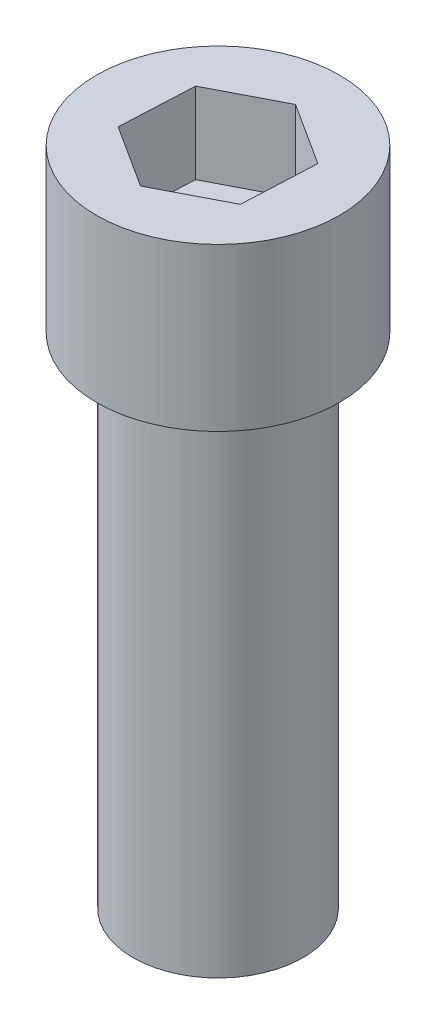
ISO-10303-21;
HEADER;
FILE_DESCRIPTION(('STEP AP214'),'2;1');
FILE_NAME('part.step','',(''),(''),'','','');
FILE_SCHEMA(('AUTOMOTIVE_DESIGN { 1 0 10303 214 1 1 1 1 }'));
ENDSEC;
DATA;
#1=APPLICATION_CONTEXT('core data for automotive mechanical design processes');
#2=APPLICATION_PROTOCOL_DEFINITION('international standard','automotive_design',2000,#1);
#3=PRODUCT_CONTEXT('',#1,'mechanical');
#4=PRODUCT('Part','Part','',(#3));
#5=PRODUCT_RELATED_PRODUCT_CATEGORY('part','',(#4));
#6=PRODUCT_DEFINITION_FORMATION('','',#4);
#7=PRODUCT_DEFINITION_CONTEXT('part definition',#1,'design');
#8=PRODUCT_DEFINITION('design','',#6,#7);
#9=PRODUCT_DEFINITION_SHAPE('','',#8);
#10=(LENGTH_UNIT() NAMED_UNIT(*) SI_UNIT(.MILLI.,.METRE.));
#11=(NAMED_UNIT(*) PLANE_ANGLE_UNIT() SI_UNIT($,.RADIAN.));
#12=(NAMED_UNIT(*) SI_UNIT($,.STERADIAN.) SOLID_ANGLE_UNIT());
#13=UNCERTAINTY_MEASURE_WITH_UNIT(LENGTH_MEASURE(1.E-05),#10,'distance_accuracy_value','');
#14=(GEOMETRIC_REPRESENTATION_CONTEXT(3) GLOBAL_UNCERTAINTY_ASSIGNED_CONTEXT((#13)) GLOBAL_UNIT_ASSIGNED_CONTEXT((#10,
#11,#12)) REPRESENTATION_CONTEXT('',''));
#15=CARTESIAN_POINT('',(0.,0.,0.));
#16=DIRECTION('',(0.,0.,1.));
#17=DIRECTION('',(1.,0.,0.));
#18=AXIS2_PLACEMENT_3D('',#15,#16,#17);
#19=CARTESIAN_POINT('',(0.,34.8,0.));
#20=DIRECTION('',(0.,-1.,0.));
#21=DIRECTION('',(0.,0.,-1.));
#22=AXIS2_PLACEMENT_3D('',#19,#20,#21);
#23=CYLINDRICAL_SURFACE('',#22,5.25);
#24=CARTESIAN_POINT('',(0.,34.8,0.));
#25=DIRECTION('',(0.,1.,0.));
#26=DIRECTION('',(0.,0.,1.));
#27=AXIS2_PLACEMENT_3D('',#24,#25,#26);
#28=CIRCLE('',#27,5.25);
#29=CARTESIAN_POINT('',(0.,34.8,5.25));
#30=VERTEX_POINT('',#29);
#31=EDGE_CURVE('E11',#30,#30,#28,.T.);
#32=ORIENTED_EDGE('',*,*,#31,.F.);
#33=EDGE_LOOP('',(#32));
#34=FACE_BOUND('',#33,.T.);
#35=CARTESIAN_POINT('',(0.,4.,0.));
#36=DIRECTION('',(0.,-1.,0.));
#37=DIRECTION('',(0.,0.,-1.));
#38=AXIS2_PLACEMENT_3D('',#35,#36,#37);
#39=CIRCLE('',#38,5.25);
#40=CARTESIAN_POINT('',(0.,4.,-5.25));
#41=VERTEX_POINT('',#40);
#42=EDGE_CURVE('E135',#41,#41,#39,.T.);
#43=ORIENTED_EDGE('',*,*,#42,.F.);
#44=EDGE_LOOP('',(#43));
#45=FACE_BOUND('',#44,.T.);
#46=ADVANCED_FACE('F39',(#34,#45),#23,.T.);
#47=CARTESIAN_POINT('',(0.,34.8,0.));
#48=DIRECTION('',(0.,1.,0.));
#49=DIRECTION('',(0.,0.,1.));
#50=AXIS2_PLACEMENT_3D('',#47,#48,#49);
#51=PLANE('',#50);
#52=CARTESIAN_POINT('',(0.,34.8,0.));
#53=DIRECTION('',(0.,1.,0.));
#54=DIRECTION('',(0.,0.,1.));
#55=AXIS2_PLACEMENT_3D('',#52,#53,#54);
#56=CIRCLE('',#55,7.5);
#57=CARTESIAN_POINT('',(0.,34.8,7.5));
#58=VERTEX_POINT('',#57);
#59=EDGE_CURVE('E154',#58,#58,#56,.T.);
#60=ORIENTED_EDGE('',*,*,#59,.F.);
#61=EDGE_LOOP('',(#60));
#62=FACE_BOUND('',#61,.T.);
#63=ORIENTED_EDGE('',*,*,#31,.T.);
#64=EDGE_LOOP('',(#63));
#65=FACE_BOUND('',#64,.T.);
#66=ADVANCED_FACE('F172',(#62,#65),#51,.F.);
#67=CARTESIAN_POINT('',(0.,44.8,0.));
#68=DIRECTION('',(0.,-1.,0.));
#69=DIRECTION('',(0.,0.,-1.));
#70=AXIS2_PLACEMENT_3D('',#67,#68,#69);
#71=CYLINDRICAL_SURFACE('',#70,7.5);
#72=CARTESIAN_POINT('',(0.,44.8,0.));
#73=DIRECTION('',(0.,1.,0.));
#74=DIRECTION('',(0.,0.,1.));
#75=AXIS2_PLACEMENT_3D('',#72,#73,#74);
#76=CIRCLE('',#75,7.5);
#77=CARTESIAN_POINT('',(0.,44.8,7.5));
#78=VERTEX_POINT('',#77);
#79=EDGE_CURVE('E47',#78,#78,#76,.T.);
#80=ORIENTED_EDGE('',*,*,#79,.F.);
#81=EDGE_LOOP('',(#80));
#82=FACE_BOUND('',#81,.T.);
#83=ORIENTED_EDGE('',*,*,#59,.T.);
#84=EDGE_LOOP('',(#83));
#85=FACE_BOUND('',#84,.T.);
#86=ADVANCED_FACE('F170',(#82,#85),#71,.T.);
#87=CARTESIAN_POINT('',(0.,44.8,0.));
#88=DIRECTION('',(0.,1.,0.));
#89=DIRECTION('',(0.,0.,1.));
#90=AXIS2_PLACEMENT_3D('',#87,#88,#89);
#91=PLANE('',#90);
#92=DIRECTION('',(-0.841859471217915,0.,-0.539696795173634));
#93=VECTOR('',#92,1.);
#94=CARTESIAN_POINT('',(4.06379105691766,44.8,-2.10080339720881));
#95=LINE('',#94,#93);
#96=CARTESIAN_POINT('',(4.06379105691766,44.8,-2.10080339720881));
#97=VERTEX_POINT('',#96);
#98=CARTESIAN_POINT('',(0.212546418119348,44.8,-4.56974798956711));
#99=VERTEX_POINT('',#98);
#100=EDGE_CURVE('E54',#97,#99,#95,.T.);
#101=ORIENTED_EDGE('',*,*,#100,.F.);
#102=DIRECTION('',(0.046461399352456,0.,-0.998920086078066));
#103=VECTOR('',#102,1.);
#104=CARTESIAN_POINT('',(3.85124463879831,44.8,2.4689445923583));
#105=LINE('',#104,#103);
#106=CARTESIAN_POINT('',(3.85124463879831,44.8,2.4689445923583));
#107=VERTEX_POINT('',#106);
#108=EDGE_CURVE('E148',#107,#97,#105,.T.);
#109=ORIENTED_EDGE('',*,*,#108,.F.);
#110=DIRECTION('',(0.888320870570372,0.,-0.459223290904432));
#111=VECTOR('',#110,1.);
#112=CARTESIAN_POINT('',(-0.212546418119345,44.8,4.56974798956711));
#113=LINE('',#112,#111);
#114=CARTESIAN_POINT('',(-0.212546418119345,44.8,4.56974798956711));
#115=VERTEX_POINT('',#114);
#116=EDGE_CURVE('E145',#115,#107,#113,.T.);
#117=ORIENTED_EDGE('',*,*,#116,.F.);
#118=DIRECTION('',(0.841859471217915,0.,0.539696795173634));
#119=VECTOR('',#118,1.);
#120=CARTESIAN_POINT('',(-4.06379105691766,44.8,2.10080339720881));
#121=LINE('',#120,#119);
#122=CARTESIAN_POINT('',(-4.06379105691766,44.8,2.10080339720881));
#123=VERTEX_POINT('',#122);
#124=EDGE_CURVE('E102',#123,#115,#121,.T.);
#125=ORIENTED_EDGE('',*,*,#124,.F.);
#126=DIRECTION('',(-0.0464613993524562,0.,0.998920086078066));
#127=VECTOR('',#126,1.);
#128=CARTESIAN_POINT('',(-3.85124463879831,44.8,-2.4689445923583));
#129=LINE('',#128,#127);
#130=CARTESIAN_POINT('',(-3.85124463879831,44.8,-2.4689445923583));
#131=VERTEX_POINT('',#130);
#132=EDGE_CURVE('E139',#131,#123,#129,.T.);
#133=ORIENTED_EDGE('',*,*,#132,.F.);
#134=DIRECTION('',(-0.888320870570372,0.,0.459223290904432));
#135=VECTOR('',#134,1.);
#136=CARTESIAN_POINT('',(0.212546418119348,44.8,-4.56974798956711));
#137=LINE('',#136,#135);
#138=EDGE_CURVE('E134',#99,#131,#137,.T.);
#139=ORIENTED_EDGE('',*,*,#138,.F.);
#140=EDGE_LOOP('',(#101,#109,#117,#125,#133,#139));
#141=FACE_BOUND('',#140,.T.);
#142=ORIENTED_EDGE('',*,*,#79,.T.);
#143=EDGE_LOOP('',(#142));
#144=FACE_BOUND('',#143,.T.);
#145=ADVANCED_FACE('F195',(#141,#144),#91,.T.);
#146=CARTESIAN_POINT('',(4.06379105691766,39.8,-2.10080339720881));
#147=DIRECTION('',(0.539696795173634,0.,-0.841859471217916));
#148=DIRECTION('',(-0.841859471217915,0.,-0.539696795173634));
#149=AXIS2_PLACEMENT_3D('',#146,#147,#148);
#150=PLANE('',#149);
#151=ORIENTED_EDGE('',*,*,#100,.T.);
#152=DIRECTION('',(0.,1.,0.));
#153=VECTOR('',#152,1.);
#154=CARTESIAN_POINT('',(0.212546418119348,39.8,-4.56974798956711));
#155=LINE('',#154,#153);
#156=CARTESIAN_POINT('',(0.212546418119348,39.8,-4.56974798956711));
#157=VERTEX_POINT('',#156);
#158=EDGE_CURVE('E84',#157,#99,#155,.T.);
#159=ORIENTED_EDGE('',*,*,#158,.F.);
#160=DIRECTION('',(-0.841859471217915,0.,-0.539696795173634));
#161=VECTOR('',#160,1.);
#162=CARTESIAN_POINT('',(4.06379105691766,39.8,-2.10080339720881));
#163=LINE('',#162,#161);
#164=CARTESIAN_POINT('',(4.06379105691766,39.8,-2.10080339720881));
#165=VERTEX_POINT('',#164);
#166=EDGE_CURVE('E151',#165,#157,#163,.T.);
#167=ORIENTED_EDGE('',*,*,#166,.F.);
#168=DIRECTION('',(0.,1.,0.));
#169=VECTOR('',#168,1.);
#170=CARTESIAN_POINT('',(4.06379105691766,39.8,-2.10080339720881));
#171=LINE('',#170,#169);
#172=EDGE_CURVE('E62',#165,#97,#171,.T.);
#173=ORIENTED_EDGE('',*,*,#172,.T.);
#174=EDGE_LOOP('',(#151,#159,#167,#173));
#175=FACE_BOUND('',#174,.T.);
#176=ADVANCED_FACE('F200',(#175),#150,.F.);
#177=CARTESIAN_POINT('',(3.85124463879831,39.8,2.4689445923583));
#178=DIRECTION('',(0.998920086078066,0.,0.046461399352456));
#179=DIRECTION('',(0.046461399352456,0.,-0.998920086078067));
#180=AXIS2_PLACEMENT_3D('',#177,#178,#179);
#181=PLANE('',#180);
#182=ORIENTED_EDGE('',*,*,#108,.T.);
#183=ORIENTED_EDGE('',*,*,#172,.F.);
#184=DIRECTION('',(0.046461399352456,0.,-0.998920086078066));
#185=VECTOR('',#184,1.);
#186=CARTESIAN_POINT('',(3.85124463879831,39.8,2.4689445923583));
#187=LINE('',#186,#185);
#188=CARTESIAN_POINT('',(3.85124463879831,39.8,2.4689445923583));
#189=VERTEX_POINT('',#188);
#190=EDGE_CURVE('E116',#189,#165,#187,.T.);
#191=ORIENTED_EDGE('',*,*,#190,.F.);
#192=DIRECTION('',(0.,1.,0.));
#193=VECTOR('',#192,1.);
#194=CARTESIAN_POINT('',(3.85124463879831,39.8,2.4689445923583));
#195=LINE('',#194,#193);
#196=EDGE_CURVE('E107',#189,#107,#195,.T.);
#197=ORIENTED_EDGE('',*,*,#196,.T.);
#198=EDGE_LOOP('',(#182,#183,#191,#197));
#199=FACE_BOUND('',#198,.T.);
#200=ADVANCED_FACE('F198',(#199),#181,.F.);
#201=CARTESIAN_POINT('',(-0.212546418119345,39.8,4.56974798956711));
#202=DIRECTION('',(0.459223290904432,0.,0.888320870570372));
#203=DIRECTION('',(0.888320870570372,0.,-0.459223290904432));
#204=AXIS2_PLACEMENT_3D('',#201,#202,#203);
#205=PLANE('',#204);
#206=ORIENTED_EDGE('',*,*,#116,.T.);
#207=ORIENTED_EDGE('',*,*,#196,.F.);
#208=DIRECTION('',(0.888320870570372,0.,-0.459223290904432));
#209=VECTOR('',#208,1.);
#210=CARTESIAN_POINT('',(-0.212546418119345,39.8,4.56974798956711));
#211=LINE('',#210,#209);
#212=CARTESIAN_POINT('',(-0.212546418119345,39.8,4.56974798956711));
#213=VERTEX_POINT('',#212);
#214=EDGE_CURVE('E111',#213,#189,#211,.T.);
#215=ORIENTED_EDGE('',*,*,#214,.F.);
#216=DIRECTION('',(0.,1.,0.));
#217=VECTOR('',#216,1.);
#218=CARTESIAN_POINT('',(-0.212546418119345,39.8,4.56974798956711));
#219=LINE('',#218,#217);
#220=EDGE_CURVE('E95',#213,#115,#219,.T.);
#221=ORIENTED_EDGE('',*,*,#220,.T.);
#222=EDGE_LOOP('',(#206,#207,#215,#221));
#223=FACE_BOUND('',#222,.T.);
#224=ADVANCED_FACE('F112',(#223),#205,.F.);
#225=CARTESIAN_POINT('',(-4.06379105691766,39.8,2.10080339720881));
#226=DIRECTION('',(-0.539696795173634,0.,0.841859471217916));
#227=DIRECTION('',(0.841859471217916,0.,0.539696795173634));
#228=AXIS2_PLACEMENT_3D('',#225,#226,#227);
#229=PLANE('',#228);
#230=ORIENTED_EDGE('',*,*,#124,.T.);
#231=ORIENTED_EDGE('',*,*,#220,.F.);
#232=DIRECTION('',(0.841859471217915,0.,0.539696795173634));
#233=VECTOR('',#232,1.);
#234=CARTESIAN_POINT('',(-4.06379105691766,39.8,2.10080339720881));
#235=LINE('',#234,#233);
#236=CARTESIAN_POINT('',(-4.06379105691766,39.8,2.10080339720881));
#237=VERTEX_POINT('',#236);
#238=EDGE_CURVE('E99',#237,#213,#235,.T.);
#239=ORIENTED_EDGE('',*,*,#238,.F.);
#240=DIRECTION('',(0.,1.,0.));
#241=VECTOR('',#240,1.);
#242=CARTESIAN_POINT('',(-4.06379105691766,39.8,2.10080339720881));
#243=LINE('',#242,#241);
#244=EDGE_CURVE('E108',#237,#123,#243,.T.);
#245=ORIENTED_EDGE('',*,*,#244,.T.);
#246=EDGE_LOOP('',(#230,#231,#239,#245));
#247=FACE_BOUND('',#246,.T.);
#248=ADVANCED_FACE('F97',(#247),#229,.F.);
#249=CARTESIAN_POINT('',(-3.85124463879831,39.8,-2.4689445923583));
#250=DIRECTION('',(-0.998920086078066,0.,-0.0464613993524562));
#251=DIRECTION('',(-0.0464613993524562,0.,0.998920086078067));
#252=AXIS2_PLACEMENT_3D('',#249,#250,#251);
#253=PLANE('',#252);
#254=ORIENTED_EDGE('',*,*,#132,.T.);
#255=ORIENTED_EDGE('',*,*,#244,.F.);
#256=DIRECTION('',(-0.0464613993524562,0.,0.998920086078066));
#257=VECTOR('',#256,1.);
#258=CARTESIAN_POINT('',(-3.85124463879831,39.8,-2.4689445923583));
#259=LINE('',#258,#257);
#260=CARTESIAN_POINT('',(-3.85124463879831,39.8,-2.4689445923583));
#261=VERTEX_POINT('',#260);
#262=EDGE_CURVE('E122',#261,#237,#259,.T.);
#263=ORIENTED_EDGE('',*,*,#262,.F.);
#264=DIRECTION('',(0.,1.,0.));
#265=VECTOR('',#264,1.);
#266=CARTESIAN_POINT('',(-3.85124463879831,39.8,-2.4689445923583));
#267=LINE('',#266,#265);
#268=EDGE_CURVE('E159',#261,#131,#267,.T.);
#269=ORIENTED_EDGE('',*,*,#268,.T.);
#270=EDGE_LOOP('',(#254,#255,#263,#269));
#271=FACE_BOUND('',#270,.T.);
#272=ADVANCED_FACE('F193',(#271),#253,.F.);
#273=CARTESIAN_POINT('',(0.212546418119348,39.8,-4.56974798956711));
#274=DIRECTION('',(-0.459223290904432,0.,-0.888320870570372));
#275=DIRECTION('',(-0.888320870570372,0.,0.459223290904432));
#276=AXIS2_PLACEMENT_3D('',#273,#274,#275);
#277=PLANE('',#276);
#278=ORIENTED_EDGE('',*,*,#138,.T.);
#279=ORIENTED_EDGE('',*,*,#268,.F.);
#280=DIRECTION('',(-0.888320870570372,0.,0.459223290904432));
#281=VECTOR('',#280,1.);
#282=CARTESIAN_POINT('',(0.212546418119348,39.8,-4.56974798956711));
#283=LINE('',#282,#281);
#284=EDGE_CURVE('E126',#157,#261,#283,.T.);
#285=ORIENTED_EDGE('',*,*,#284,.F.);
#286=ORIENTED_EDGE('',*,*,#158,.T.);
#287=EDGE_LOOP('',(#278,#279,#285,#286));
#288=FACE_BOUND('',#287,.T.);
#289=ADVANCED_FACE('F189',(#288),#277,.F.);
#290=CARTESIAN_POINT('',(0.,39.8,0.));
#291=DIRECTION('',(0.,1.,0.));
#292=DIRECTION('',(0.,0.,1.));
#293=AXIS2_PLACEMENT_3D('',#290,#291,#292);
#294=PLANE('',#293);
#295=ORIENTED_EDGE('',*,*,#166,.T.);
#296=ORIENTED_EDGE('',*,*,#284,.T.);
#297=ORIENTED_EDGE('',*,*,#262,.T.);
#298=ORIENTED_EDGE('',*,*,#238,.T.);
#299=ORIENTED_EDGE('',*,*,#214,.T.);
#300=ORIENTED_EDGE('',*,*,#190,.T.);
#301=EDGE_LOOP('',(#295,#296,#297,#298,#299,#300));
#302=FACE_BOUND('',#301,.T.);
#303=ADVANCED_FACE('F119',(#302),#294,.T.);
#304=CARTESIAN_POINT('',(0.,4.,0.));
#305=DIRECTION('',(0.,-1.,0.));
#306=DIRECTION('',(0.,0.,-1.));
#307=AXIS2_PLACEMENT_3D('',#304,#305,#306);
#308=PLANE('',#307);
#309=ORIENTED_EDGE('',*,*,#42,.T.);
#310=EDGE_LOOP('',(#309));
#311=FACE_BOUND('',#310,.T.);
#312=ADVANCED_FACE('F270',(#311),#308,.T.);
#313=CLOSED_SHELL('',(#46,#66,#86,#145,#176,#200,#224,#248,#272,#289,#303,#312));
#314=MANIFOLD_SOLID_BREP('B2',#313);
#315=ADVANCED_BREP_SHAPE_REPRESENTATION('',(#18,#314),#14);
#316=SHAPE_DEFINITION_REPRESENTATION(#9,#315);
ENDSEC;
END-ISO-10303-21;
